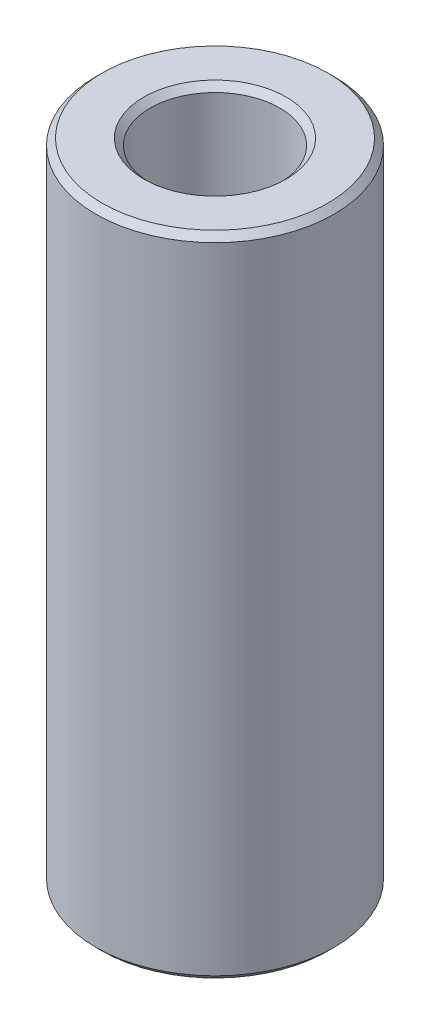
ISO-10303-21;
HEADER;
FILE_DESCRIPTION(('STEP AP214'),'2;1');
FILE_NAME('part.step','',(''),(''),'','','');
FILE_SCHEMA(('AUTOMOTIVE_DESIGN { 1 0 10303 214 1 1 1 1 }'));
ENDSEC;
DATA;
#1=APPLICATION_CONTEXT('core data for automotive mechanical design processes');
#2=APPLICATION_PROTOCOL_DEFINITION('international standard','automotive_design',2000,#1);
#3=PRODUCT_CONTEXT('',#1,'mechanical');
#4=PRODUCT('Part','Part','',(#3));
#5=PRODUCT_RELATED_PRODUCT_CATEGORY('part','',(#4));
#6=PRODUCT_DEFINITION_FORMATION('','',#4);
#7=PRODUCT_DEFINITION_CONTEXT('part definition',#1,'design');
#8=PRODUCT_DEFINITION('design','',#6,#7);
#9=PRODUCT_DEFINITION_SHAPE('','',#8);
#10=(LENGTH_UNIT() NAMED_UNIT(*) SI_UNIT(.MILLI.,.METRE.));
#11=(NAMED_UNIT(*) PLANE_ANGLE_UNIT() SI_UNIT($,.RADIAN.));
#12=(NAMED_UNIT(*) SI_UNIT($,.STERADIAN.) SOLID_ANGLE_UNIT());
#13=UNCERTAINTY_MEASURE_WITH_UNIT(LENGTH_MEASURE(1.E-05),#10,'distance_accuracy_value','');
#14=(GEOMETRIC_REPRESENTATION_CONTEXT(3) GLOBAL_UNCERTAINTY_ASSIGNED_CONTEXT((#13)) GLOBAL_UNIT_ASSIGNED_CONTEXT((#10,
#11,#12)) REPRESENTATION_CONTEXT('',''));
#15=CARTESIAN_POINT('',(0.,0.,0.));
#16=DIRECTION('',(0.,0.,1.));
#17=DIRECTION('',(1.,0.,0.));
#18=AXIS2_PLACEMENT_3D('',#15,#16,#17);
#19=CARTESIAN_POINT('',(0.,312.498664850989,0.));
#20=DIRECTION('',(0.,-1.,0.));
#21=DIRECTION('',(0.,0.,-1.));
#22=AXIS2_PLACEMENT_3D('',#19,#20,#21);
#23=CYLINDRICAL_SURFACE('',#22,57.5);
#24=CARTESIAN_POINT('',(0.,3.05874733728906,0.));
#25=DIRECTION('',(0.,1.,0.));
#26=DIRECTION('',(0.,0.,1.));
#27=AXIS2_PLACEMENT_3D('',#24,#25,#26);
#28=CIRCLE('',#27,57.5);
#29=CARTESIAN_POINT('',(0.,3.05874733728906,57.5));
#30=VERTEX_POINT('',#29);
#31=EDGE_CURVE('E10',#30,#30,#28,.T.);
#32=ORIENTED_EDGE('',*,*,#31,.T.);
#33=EDGE_LOOP('',(#32));
#34=FACE_BOUND('',#33,.T.);
#35=CARTESIAN_POINT('',(0.,309.4399175137,0.));
#36=DIRECTION('',(0.,1.,0.));
#37=DIRECTION('',(0.,0.,1.));
#38=AXIS2_PLACEMENT_3D('',#35,#36,#37);
#39=CIRCLE('',#38,57.5);
#40=CARTESIAN_POINT('',(0.,309.4399175137,57.5));
#41=VERTEX_POINT('',#40);
#42=EDGE_CURVE('E50',#41,#41,#39,.F.);
#43=ORIENTED_EDGE('',*,*,#42,.T.);
#44=EDGE_LOOP('',(#43));
#45=FACE_BOUND('',#44,.T.);
#46=ADVANCED_FACE('F39',(#34,#45),#23,.T.);
#47=CARTESIAN_POINT('',(0.,312.498664850989,0.));
#48=DIRECTION('',(0.,1.,0.));
#49=DIRECTION('',(0.,0.,1.));
#50=AXIS2_PLACEMENT_3D('',#47,#48,#49);
#51=PLANE('',#50);
#52=CARTESIAN_POINT('',(0.,312.498664850989,0.));
#53=DIRECTION('',(0.,1.,0.));
#54=DIRECTION('',(0.,0.,1.));
#55=AXIS2_PLACEMENT_3D('',#52,#53,#54);
#56=CIRCLE('',#55,34.341340807846);
#57=CARTESIAN_POINT('',(0.,312.498664850989,34.341340807846));
#58=VERTEX_POINT('',#57);
#59=EDGE_CURVE('E58',#58,#58,#56,.F.);
#60=ORIENTED_EDGE('',*,*,#59,.T.);
#61=EDGE_LOOP('',(#60));
#62=FACE_BOUND('',#61,.T.);
#63=CARTESIAN_POINT('',(0.,312.498664850989,0.));
#64=DIRECTION('',(0.,1.,0.));
#65=DIRECTION('',(0.,0.,1.));
#66=AXIS2_PLACEMENT_3D('',#63,#64,#65);
#67=CIRCLE('',#66,54.4412526627109);
#68=CARTESIAN_POINT('',(0.,312.498664850989,54.4412526627109));
#69=VERTEX_POINT('',#68);
#70=EDGE_CURVE('E61',#69,#69,#67,.T.);
#71=ORIENTED_EDGE('',*,*,#70,.T.);
#72=EDGE_LOOP('',(#71));
#73=FACE_BOUND('',#72,.T.);
#74=ADVANCED_FACE('F88',(#62,#73),#51,.T.);
#75=CARTESIAN_POINT('',(0.,0.,0.));
#76=DIRECTION('',(0.,1.,0.));
#77=DIRECTION('',(0.,0.,1.));
#78=AXIS2_PLACEMENT_3D('',#75,#76,#77);
#79=PLANE('',#78);
#80=CARTESIAN_POINT('',(0.,0.,0.));
#81=DIRECTION('',(0.,1.,0.));
#82=DIRECTION('',(0.,0.,1.));
#83=AXIS2_PLACEMENT_3D('',#80,#81,#82);
#84=CIRCLE('',#83,34.3413408078461);
#85=CARTESIAN_POINT('',(0.,0.,34.3413408078461));
#86=VERTEX_POINT('',#85);
#87=EDGE_CURVE('E51',#86,#86,#84,.T.);
#88=ORIENTED_EDGE('',*,*,#87,.T.);
#89=EDGE_LOOP('',(#88));
#90=FACE_BOUND('',#89,.T.);
#91=CARTESIAN_POINT('',(0.,0.,0.));
#92=DIRECTION('',(0.,1.,0.));
#93=DIRECTION('',(0.,0.,1.));
#94=AXIS2_PLACEMENT_3D('',#91,#92,#93);
#95=CIRCLE('',#94,54.4412526627109);
#96=CARTESIAN_POINT('',(0.,0.,54.4412526627109));
#97=VERTEX_POINT('',#96);
#98=EDGE_CURVE('E54',#97,#97,#95,.F.);
#99=ORIENTED_EDGE('',*,*,#98,.T.);
#100=EDGE_LOOP('',(#99));
#101=FACE_BOUND('',#100,.T.);
#102=ADVANCED_FACE('F83',(#90,#101),#79,.F.);
#103=CARTESIAN_POINT('',(0.,312.498664850989,0.));
#104=DIRECTION('',(0.,-1.,0.));
#105=DIRECTION('',(0.,0.,-1.));
#106=AXIS2_PLACEMENT_3D('',#103,#104,#105);
#107=CYLINDRICAL_SURFACE('',#106,31.282593470557);
#108=CARTESIAN_POINT('',(0.,309.4399175137,0.));
#109=DIRECTION('',(0.,1.,0.));
#110=DIRECTION('',(0.,0.,1.));
#111=AXIS2_PLACEMENT_3D('',#108,#109,#110);
#112=CIRCLE('',#111,31.282593470557);
#113=CARTESIAN_POINT('',(0.,309.4399175137,31.282593470557));
#114=VERTEX_POINT('',#113);
#115=EDGE_CURVE('E67',#114,#114,#112,.T.);
#116=ORIENTED_EDGE('',*,*,#115,.T.);
#117=EDGE_LOOP('',(#116));
#118=FACE_BOUND('',#117,.T.);
#119=CARTESIAN_POINT('',(0.,3.05874733728906,0.));
#120=DIRECTION('',(0.,1.,0.));
#121=DIRECTION('',(0.,0.,1.));
#122=AXIS2_PLACEMENT_3D('',#119,#120,#121);
#123=CIRCLE('',#122,31.282593470557);
#124=CARTESIAN_POINT('',(0.,3.05874733728906,31.282593470557));
#125=VERTEX_POINT('',#124);
#126=EDGE_CURVE('E69',#125,#125,#123,.F.);
#127=ORIENTED_EDGE('',*,*,#126,.T.);
#128=EDGE_LOOP('',(#127));
#129=FACE_BOUND('',#128,.T.);
#130=ADVANCED_FACE('F71',(#118,#129),#107,.F.);
#131=CARTESIAN_POINT('',(0.,309.4399175137,0.));
#132=DIRECTION('',(0.,1.,0.));
#133=DIRECTION('',(0.,0.,1.));
#134=AXIS2_PLACEMENT_3D('',#131,#132,#133);
#135=CONICAL_SURFACE('',#134,31.282593470557,0.785398163397457);
#136=ORIENTED_EDGE('',*,*,#59,.F.);
#137=EDGE_LOOP('',(#136));
#138=FACE_BOUND('',#137,.T.);
#139=ORIENTED_EDGE('',*,*,#115,.F.);
#140=EDGE_LOOP('',(#139));
#141=FACE_BOUND('',#140,.T.);
#142=ADVANCED_FACE('F77',(#138,#141),#135,.F.);
#143=CARTESIAN_POINT('',(0.,0.,0.));
#144=DIRECTION('',(0.,-1.,0.));
#145=DIRECTION('',(0.,0.,-1.));
#146=AXIS2_PLACEMENT_3D('',#143,#144,#145);
#147=CONICAL_SURFACE('',#146,34.3413408078461,0.785398163397453);
#148=ORIENTED_EDGE('',*,*,#126,.F.);
#149=EDGE_LOOP('',(#148));
#150=FACE_BOUND('',#149,.T.);
#151=ORIENTED_EDGE('',*,*,#87,.F.);
#152=EDGE_LOOP('',(#151));
#153=FACE_BOUND('',#152,.T.);
#154=ADVANCED_FACE('F73',(#150,#153),#147,.F.);
#155=CARTESIAN_POINT('',(0.,3.05874733728906,0.));
#156=DIRECTION('',(0.,1.,0.));
#157=DIRECTION('',(0.,0.,1.));
#158=AXIS2_PLACEMENT_3D('',#155,#156,#157);
#159=CONICAL_SURFACE('',#158,57.5,0.785398163397448);
#160=ORIENTED_EDGE('',*,*,#98,.F.);
#161=EDGE_LOOP('',(#160));
#162=FACE_BOUND('',#161,.T.);
#163=ORIENTED_EDGE('',*,*,#31,.F.);
#164=EDGE_LOOP('',(#163));
#165=FACE_BOUND('',#164,.T.);
#166=ADVANCED_FACE('F76',(#162,#165),#159,.T.);
#167=CARTESIAN_POINT('',(0.,312.498664850989,0.));
#168=DIRECTION('',(0.,-1.,0.));
#169=DIRECTION('',(0.,0.,-1.));
#170=AXIS2_PLACEMENT_3D('',#167,#168,#169);
#171=CONICAL_SURFACE('',#170,54.4412526627109,0.78539816339744);
#172=ORIENTED_EDGE('',*,*,#42,.F.);
#173=EDGE_LOOP('',(#172));
#174=FACE_BOUND('',#173,.T.);
#175=ORIENTED_EDGE('',*,*,#70,.F.);
#176=EDGE_LOOP('',(#175));
#177=FACE_BOUND('',#176,.T.);
#178=ADVANCED_FACE('F45',(#174,#177),#171,.T.);
#179=CLOSED_SHELL('',(#46,#74,#102,#130,#142,#154,#166,#178));
#180=MANIFOLD_SOLID_BREP('B2',#179);
#181=ADVANCED_BREP_SHAPE_REPRESENTATION('',(#18,#180),#14);
#182=SHAPE_DEFINITION_REPRESENTATION(#9,#181);
ENDSEC;
END-ISO-10303-21;
